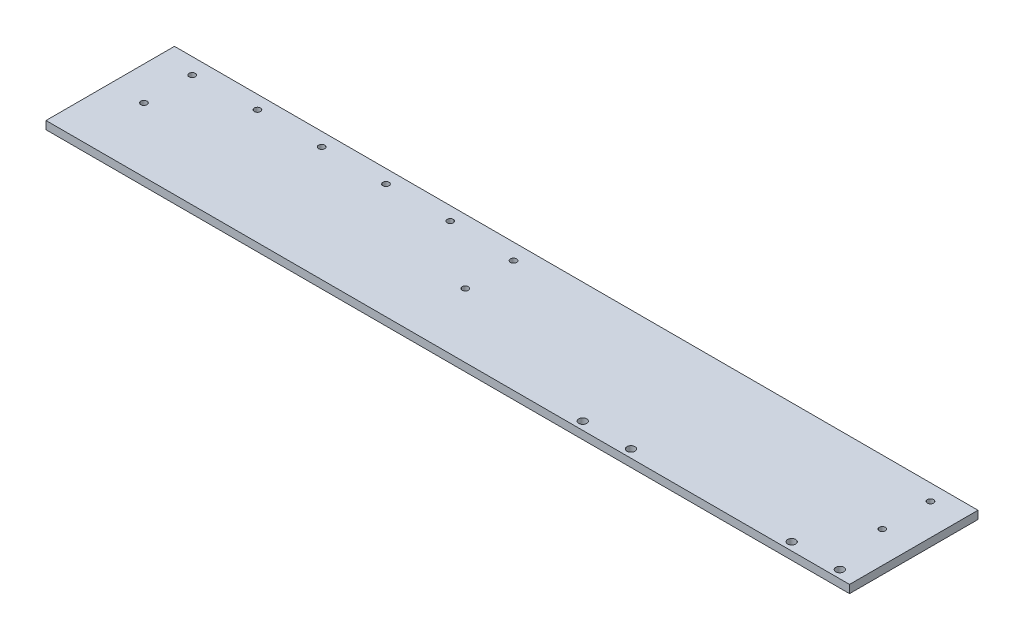
ISO-10303-21;
HEADER;
FILE_DESCRIPTION(('STEP AP214'),'2;1');
FILE_NAME('part.step','',(''),(''),'','','');
FILE_SCHEMA(('AUTOMOTIVE_DESIGN { 1 0 10303 214 1 1 1 1 }'));
ENDSEC;
DATA;
#1=APPLICATION_CONTEXT('core data for automotive mechanical design processes');
#2=APPLICATION_PROTOCOL_DEFINITION('international standard','automotive_design',2000,#1);
#3=PRODUCT_CONTEXT('',#1,'mechanical');
#4=PRODUCT('Part','Part','',(#3));
#5=PRODUCT_RELATED_PRODUCT_CATEGORY('part','',(#4));
#6=PRODUCT_DEFINITION_FORMATION('','',#4);
#7=PRODUCT_DEFINITION_CONTEXT('part definition',#1,'design');
#8=PRODUCT_DEFINITION('design','',#6,#7);
#9=PRODUCT_DEFINITION_SHAPE('','',#8);
#10=(LENGTH_UNIT() NAMED_UNIT(*) SI_UNIT(.MILLI.,.METRE.));
#11=(NAMED_UNIT(*) PLANE_ANGLE_UNIT() SI_UNIT($,.RADIAN.));
#12=(NAMED_UNIT(*) SI_UNIT($,.STERADIAN.) SOLID_ANGLE_UNIT());
#13=UNCERTAINTY_MEASURE_WITH_UNIT(LENGTH_MEASURE(1.E-05),#10,'distance_accuracy_value','');
#14=(GEOMETRIC_REPRESENTATION_CONTEXT(3) GLOBAL_UNCERTAINTY_ASSIGNED_CONTEXT((#13)) GLOBAL_UNIT_ASSIGNED_CONTEXT((#10,
#11,#12)) REPRESENTATION_CONTEXT('',''));
#15=CARTESIAN_POINT('',(0.,0.,0.));
#16=DIRECTION('',(0.,0.,1.));
#17=DIRECTION('',(1.,0.,0.));
#18=AXIS2_PLACEMENT_3D('',#15,#16,#17);
#19=CARTESIAN_POINT('',(0.,6.35,0.));
#20=DIRECTION('',(0.,1.,0.));
#21=DIRECTION('',(0.,0.,1.));
#22=AXIS2_PLACEMENT_3D('',#19,#20,#21);
#23=PLANE('',#22);
#24=CARTESIAN_POINT('',(-139.700000000015,6.35,-40.0955048344385));
#25=DIRECTION('',(0.,1.,0.));
#26=DIRECTION('',(0.,0.,1.));
#27=AXIS2_PLACEMENT_3D('',#24,#25,#26);
#28=CIRCLE('',#27,2.4638);
#29=CARTESIAN_POINT('',(-139.700000000015,6.35,-37.6317048344385));
#30=VERTEX_POINT('',#29);
#31=EDGE_CURVE('E224',#30,#30,#28,.T.);
#32=ORIENTED_EDGE('',*,*,#31,.F.);
#33=EDGE_LOOP('',(#32));
#34=FACE_BOUND('',#33,.T.);
#35=CARTESIAN_POINT('',(303.53,6.35,44.4135048360669));
#36=DIRECTION('',(0.,1.,0.));
#37=DIRECTION('',(0.,0.,1.));
#38=AXIS2_PLACEMENT_3D('',#35,#36,#37);
#39=CIRCLE('',#38,3.17499999999997);
#40=CARTESIAN_POINT('',(303.53,6.35,47.5885048360669));
#41=VERTEX_POINT('',#40);
#42=EDGE_CURVE('E208',#41,#41,#39,.T.);
#43=ORIENTED_EDGE('',*,*,#42,.F.);
#44=EDGE_LOOP('',(#43));
#45=FACE_BOUND('',#44,.T.);
#46=CARTESIAN_POINT('',(-190.500000000015,6.35,-40.0955048344385));
#47=DIRECTION('',(0.,1.,0.));
#48=DIRECTION('',(0.,0.,1.));
#49=AXIS2_PLACEMENT_3D('',#46,#47,#48);
#50=CIRCLE('',#49,2.4638);
#51=CARTESIAN_POINT('',(-190.500000000015,6.35,-37.6317048344385));
#52=VERTEX_POINT('',#51);
#53=EDGE_CURVE('E192',#52,#52,#50,.T.);
#54=ORIENTED_EDGE('',*,*,#53,.F.);
#55=EDGE_LOOP('',(#54));
#56=FACE_BOUND('',#55,.T.);
#57=CARTESIAN_POINT('',(100.33,6.35,44.4135048360669));
#58=DIRECTION('',(0.,1.,0.));
#59=DIRECTION('',(0.,0.,1.));
#60=AXIS2_PLACEMENT_3D('',#57,#58,#59);
#61=CIRCLE('',#60,3.175);
#62=CARTESIAN_POINT('',(100.33,6.35,47.5885048360669));
#63=VERTEX_POINT('',#62);
#64=EDGE_CURVE('E176',#63,#63,#61,.T.);
#65=ORIENTED_EDGE('',*,*,#64,.F.);
#66=EDGE_LOOP('',(#65));
#67=FACE_BOUND('',#66,.T.);
#68=CARTESIAN_POINT('',(-36.8299999984826,6.35,0.0364951624271248));
#69=DIRECTION('',(0.,1.,0.));
#70=DIRECTION('',(0.,0.,1.));
#71=AXIS2_PLACEMENT_3D('',#68,#69,#70);
#72=CIRCLE('',#71,2.4638);
#73=CARTESIAN_POINT('',(-36.8299999984826,6.35,2.50029516242713));
#74=VERTEX_POINT('',#73);
#75=EDGE_CURVE('E160',#74,#74,#72,.T.);
#76=ORIENTED_EDGE('',*,*,#75,.F.);
#77=EDGE_LOOP('',(#76));
#78=FACE_BOUND('',#77,.T.);
#79=CARTESIAN_POINT('',(292.608,6.35,-0.0364951639330591));
#80=DIRECTION('',(0.,1.,0.));
#81=DIRECTION('',(0.,0.,1.));
#82=AXIS2_PLACEMENT_3D('',#79,#80,#81);
#83=CIRCLE('',#82,2.4638);
#84=CARTESIAN_POINT('',(292.608,6.35,2.42730483606694));
#85=VERTEX_POINT('',#84);
#86=EDGE_CURVE('E144',#85,#85,#83,.T.);
#87=ORIENTED_EDGE('',*,*,#86,.F.);
#88=EDGE_LOOP('',(#87));
#89=FACE_BOUND('',#88,.T.);
#90=CARTESIAN_POINT('',(-290.83,6.35,-38.0635048360632));
#91=DIRECTION('',(0.,1.,0.));
#92=DIRECTION('',(0.,0.,1.));
#93=AXIS2_PLACEMENT_3D('',#90,#91,#92);
#94=CIRCLE('',#93,2.4638);
#95=CARTESIAN_POINT('',(-290.83,6.35,-35.5997048360632));
#96=VERTEX_POINT('',#95);
#97=EDGE_CURVE('E114',#96,#96,#94,.T.);
#98=ORIENTED_EDGE('',*,*,#97,.F.);
#99=EDGE_LOOP('',(#98));
#100=FACE_BOUND('',#99,.T.);
#101=DIRECTION('',(0.,0.,1.));
#102=VECTOR('',#101,1.);
#103=CARTESIAN_POINT('',(-317.5,6.35,50.763504836067));
#104=LINE('',#103,#102);
#105=CARTESIAN_POINT('',(-317.5,6.35,-50.763504836067));
#106=VERTEX_POINT('',#105);
#107=CARTESIAN_POINT('',(-317.5,6.35,50.763504836067));
#108=VERTEX_POINT('',#107);
#109=EDGE_CURVE('E94',#106,#108,#104,.T.);
#110=ORIENTED_EDGE('',*,*,#109,.T.);
#111=DIRECTION('',(1.,0.,0.));
#112=VECTOR('',#111,1.);
#113=CARTESIAN_POINT('',(317.5,6.35,50.763504836067));
#114=LINE('',#113,#112);
#115=CARTESIAN_POINT('',(317.5,6.35,50.763504836067));
#116=VERTEX_POINT('',#115);
#117=EDGE_CURVE('E89',#108,#116,#114,.T.);
#118=ORIENTED_EDGE('',*,*,#117,.T.);
#119=DIRECTION('',(0.,0.,-1.));
#120=VECTOR('',#119,1.);
#121=CARTESIAN_POINT('',(317.5,6.35,50.763504836067));
#122=LINE('',#121,#120);
#123=CARTESIAN_POINT('',(317.5,6.35,-50.763504836067));
#124=VERTEX_POINT('',#123);
#125=EDGE_CURVE('E92',#116,#124,#122,.T.);
#126=ORIENTED_EDGE('',*,*,#125,.T.);
#127=DIRECTION('',(-1.,0.,0.));
#128=VECTOR('',#127,1.);
#129=CARTESIAN_POINT('',(317.5,6.35,-50.763504836067));
#130=LINE('',#129,#128);
#131=EDGE_CURVE('E59',#124,#106,#130,.T.);
#132=ORIENTED_EDGE('',*,*,#131,.T.);
#133=EDGE_LOOP('',(#110,#118,#126,#132));
#134=FACE_BOUND('',#133,.T.);
#135=CARTESIAN_POINT('',(-290.83,6.35,0.0364951639368061));
#136=DIRECTION('',(0.,1.,0.));
#137=DIRECTION('',(0.,0.,1.));
#138=AXIS2_PLACEMENT_3D('',#135,#136,#137);
#139=CIRCLE('',#138,2.4638);
#140=CARTESIAN_POINT('',(-290.83,6.35,2.50029516393681));
#141=VERTEX_POINT('',#140);
#142=EDGE_CURVE('E136',#141,#141,#139,.T.);
#143=ORIENTED_EDGE('',*,*,#142,.F.);
#144=EDGE_LOOP('',(#143));
#145=FACE_BOUND('',#144,.T.);
#146=CARTESIAN_POINT('',(292.608,6.35,-38.063504836067));
#147=DIRECTION('',(0.,1.,0.));
#148=DIRECTION('',(0.,0.,1.));
#149=AXIS2_PLACEMENT_3D('',#146,#147,#148);
#150=CIRCLE('',#149,2.4638);
#151=CARTESIAN_POINT('',(292.608,6.35,-35.599704836067));
#152=VERTEX_POINT('',#151);
#153=EDGE_CURVE('E152',#152,#152,#150,.T.);
#154=ORIENTED_EDGE('',*,*,#153,.F.);
#155=EDGE_LOOP('',(#154));
#156=FACE_BOUND('',#155,.T.);
#157=CARTESIAN_POINT('',(-241.300000000015,6.35,-40.0955048344385));
#158=DIRECTION('',(0.,1.,0.));
#159=DIRECTION('',(0.,0.,1.));
#160=AXIS2_PLACEMENT_3D('',#157,#158,#159);
#161=CIRCLE('',#160,2.4638);
#162=CARTESIAN_POINT('',(-241.300000000015,6.35,-37.6317048344385));
#163=VERTEX_POINT('',#162);
#164=EDGE_CURVE('E168',#163,#163,#161,.T.);
#165=ORIENTED_EDGE('',*,*,#164,.F.);
#166=EDGE_LOOP('',(#165));
#167=FACE_BOUND('',#166,.T.);
#168=CARTESIAN_POINT('',(-36.8299999984826,6.35,-38.0635048375729));
#169=DIRECTION('',(0.,1.,0.));
#170=DIRECTION('',(0.,0.,1.));
#171=AXIS2_PLACEMENT_3D('',#168,#169,#170);
#172=CIRCLE('',#171,2.4638);
#173=CARTESIAN_POINT('',(-36.8299999984826,6.35,-35.5997048375729));
#174=VERTEX_POINT('',#173);
#175=EDGE_CURVE('E184',#174,#174,#172,.T.);
#176=ORIENTED_EDGE('',*,*,#175,.F.);
#177=EDGE_LOOP('',(#176));
#178=FACE_BOUND('',#177,.T.);
#179=CARTESIAN_POINT('',(138.43,6.35,44.4135048360669));
#180=DIRECTION('',(0.,1.,0.));
#181=DIRECTION('',(0.,0.,1.));
#182=AXIS2_PLACEMENT_3D('',#179,#180,#181);
#183=CIRCLE('',#182,3.17499999999997);
#184=CARTESIAN_POINT('',(138.43,6.35,47.5885048360669));
#185=VERTEX_POINT('',#184);
#186=EDGE_CURVE('E200',#185,#185,#183,.T.);
#187=ORIENTED_EDGE('',*,*,#186,.F.);
#188=EDGE_LOOP('',(#187));
#189=FACE_BOUND('',#188,.T.);
#190=CARTESIAN_POINT('',(265.43,6.35,44.4135048360669));
#191=DIRECTION('',(0.,1.,0.));
#192=DIRECTION('',(0.,0.,1.));
#193=AXIS2_PLACEMENT_3D('',#190,#191,#192);
#194=CIRCLE('',#193,3.17499999999997);
#195=CARTESIAN_POINT('',(265.43,6.35,47.5885048360669));
#196=VERTEX_POINT('',#195);
#197=EDGE_CURVE('E216',#196,#196,#194,.T.);
#198=ORIENTED_EDGE('',*,*,#197,.F.);
#199=EDGE_LOOP('',(#198));
#200=FACE_BOUND('',#199,.T.);
#201=CARTESIAN_POINT('',(-88.9000000000148,6.35,-40.0955048344385));
#202=DIRECTION('',(0.,1.,0.));
#203=DIRECTION('',(0.,0.,1.));
#204=AXIS2_PLACEMENT_3D('',#201,#202,#203);
#205=CIRCLE('',#204,2.4638);
#206=CARTESIAN_POINT('',(-88.9000000000148,6.35,-37.6317048344385));
#207=VERTEX_POINT('',#206);
#208=EDGE_CURVE('E232',#207,#207,#205,.T.);
#209=ORIENTED_EDGE('',*,*,#208,.F.);
#210=EDGE_LOOP('',(#209));
#211=FACE_BOUND('',#210,.T.);
#212=ADVANCED_FACE('F41',(#34,#45,#56,#67,#78,#89,#100,#134,#145,#156,#167,#178,#189,#200,#211),
#23,.T.);
#213=CARTESIAN_POINT('',(0.,0.,0.));
#214=DIRECTION('',(0.,1.,0.));
#215=DIRECTION('',(0.,0.,1.));
#216=AXIS2_PLACEMENT_3D('',#213,#214,#215);
#217=PLANE('',#216);
#218=DIRECTION('',(0.,0.,1.));
#219=VECTOR('',#218,1.);
#220=CARTESIAN_POINT('',(-317.5,0.,50.763504836067));
#221=LINE('',#220,#219);
#222=CARTESIAN_POINT('',(-317.5,0.,-50.763504836067));
#223=VERTEX_POINT('',#222);
#224=CARTESIAN_POINT('',(-317.5,0.,50.763504836067));
#225=VERTEX_POINT('',#224);
#226=EDGE_CURVE('E110',#223,#225,#221,.T.);
#227=ORIENTED_EDGE('',*,*,#226,.F.);
#228=DIRECTION('',(-1.,0.,0.));
#229=VECTOR('',#228,1.);
#230=CARTESIAN_POINT('',(317.5,0.,-50.763504836067));
#231=LINE('',#230,#229);
#232=CARTESIAN_POINT('',(317.5,0.,-50.763504836067));
#233=VERTEX_POINT('',#232);
#234=EDGE_CURVE('E82',#233,#223,#231,.T.);
#235=ORIENTED_EDGE('',*,*,#234,.F.);
#236=DIRECTION('',(0.,0.,-1.));
#237=VECTOR('',#236,1.);
#238=CARTESIAN_POINT('',(317.5,0.,50.763504836067));
#239=LINE('',#238,#237);
#240=CARTESIAN_POINT('',(317.5,0.,50.763504836067));
#241=VERTEX_POINT('',#240);
#242=EDGE_CURVE('E76',#241,#233,#239,.T.);
#243=ORIENTED_EDGE('',*,*,#242,.F.);
#244=DIRECTION('',(1.,0.,0.));
#245=VECTOR('',#244,1.);
#246=CARTESIAN_POINT('',(317.5,0.,50.763504836067));
#247=LINE('',#246,#245);
#248=EDGE_CURVE('E99',#225,#241,#247,.T.);
#249=ORIENTED_EDGE('',*,*,#248,.F.);
#250=EDGE_LOOP('',(#227,#235,#243,#249));
#251=FACE_BOUND('',#250,.T.);
#252=CARTESIAN_POINT('',(-290.83,0.,-38.0635048360632));
#253=DIRECTION('',(0.,1.,0.));
#254=DIRECTION('',(0.,0.,1.));
#255=AXIS2_PLACEMENT_3D('',#252,#253,#254);
#256=CIRCLE('',#255,2.4638);
#257=CARTESIAN_POINT('',(-290.83,0.,-35.5997048360632));
#258=VERTEX_POINT('',#257);
#259=EDGE_CURVE('E132',#258,#258,#256,.T.);
#260=ORIENTED_EDGE('',*,*,#259,.T.);
#261=EDGE_LOOP('',(#260));
#262=FACE_BOUND('',#261,.T.);
#263=CARTESIAN_POINT('',(-290.83,0.,0.0364951639368061));
#264=DIRECTION('',(0.,1.,0.));
#265=DIRECTION('',(0.,0.,1.));
#266=AXIS2_PLACEMENT_3D('',#263,#264,#265);
#267=CIRCLE('',#266,2.4638);
#268=CARTESIAN_POINT('',(-290.83,0.,2.50029516393681));
#269=VERTEX_POINT('',#268);
#270=EDGE_CURVE('E140',#269,#269,#267,.T.);
#271=ORIENTED_EDGE('',*,*,#270,.T.);
#272=EDGE_LOOP('',(#271));
#273=FACE_BOUND('',#272,.T.);
#274=CARTESIAN_POINT('',(292.608,0.,-0.0364951639330591));
#275=DIRECTION('',(0.,1.,0.));
#276=DIRECTION('',(0.,0.,1.));
#277=AXIS2_PLACEMENT_3D('',#274,#275,#276);
#278=CIRCLE('',#277,2.4638);
#279=CARTESIAN_POINT('',(292.608,0.,2.42730483606694));
#280=VERTEX_POINT('',#279);
#281=EDGE_CURVE('E148',#280,#280,#278,.T.);
#282=ORIENTED_EDGE('',*,*,#281,.T.);
#283=EDGE_LOOP('',(#282));
#284=FACE_BOUND('',#283,.T.);
#285=CARTESIAN_POINT('',(292.608,0.,-38.063504836067));
#286=DIRECTION('',(0.,1.,0.));
#287=DIRECTION('',(0.,0.,1.));
#288=AXIS2_PLACEMENT_3D('',#285,#286,#287);
#289=CIRCLE('',#288,2.4638);
#290=CARTESIAN_POINT('',(292.608,0.,-35.599704836067));
#291=VERTEX_POINT('',#290);
#292=EDGE_CURVE('E156',#291,#291,#289,.T.);
#293=ORIENTED_EDGE('',*,*,#292,.T.);
#294=EDGE_LOOP('',(#293));
#295=FACE_BOUND('',#294,.T.);
#296=CARTESIAN_POINT('',(-36.8299999984826,0.,0.0364951624271248));
#297=DIRECTION('',(0.,1.,0.));
#298=DIRECTION('',(0.,0.,1.));
#299=AXIS2_PLACEMENT_3D('',#296,#297,#298);
#300=CIRCLE('',#299,2.4638);
#301=CARTESIAN_POINT('',(-36.8299999984826,0.,2.50029516242713));
#302=VERTEX_POINT('',#301);
#303=EDGE_CURVE('E164',#302,#302,#300,.T.);
#304=ORIENTED_EDGE('',*,*,#303,.T.);
#305=EDGE_LOOP('',(#304));
#306=FACE_BOUND('',#305,.T.);
#307=CARTESIAN_POINT('',(-241.300000000015,0.,-40.0955048344385));
#308=DIRECTION('',(0.,1.,0.));
#309=DIRECTION('',(0.,0.,1.));
#310=AXIS2_PLACEMENT_3D('',#307,#308,#309);
#311=CIRCLE('',#310,2.4638);
#312=CARTESIAN_POINT('',(-241.300000000015,0.,-37.6317048344385));
#313=VERTEX_POINT('',#312);
#314=EDGE_CURVE('E172',#313,#313,#311,.T.);
#315=ORIENTED_EDGE('',*,*,#314,.T.);
#316=EDGE_LOOP('',(#315));
#317=FACE_BOUND('',#316,.T.);
#318=CARTESIAN_POINT('',(100.33,0.,44.4135048360669));
#319=DIRECTION('',(0.,1.,0.));
#320=DIRECTION('',(0.,0.,1.));
#321=AXIS2_PLACEMENT_3D('',#318,#319,#320);
#322=CIRCLE('',#321,3.175);
#323=CARTESIAN_POINT('',(100.33,0.,47.5885048360669));
#324=VERTEX_POINT('',#323);
#325=EDGE_CURVE('E180',#324,#324,#322,.T.);
#326=ORIENTED_EDGE('',*,*,#325,.T.);
#327=EDGE_LOOP('',(#326));
#328=FACE_BOUND('',#327,.T.);
#329=CARTESIAN_POINT('',(-36.8299999984826,0.,-38.0635048375729));
#330=DIRECTION('',(0.,1.,0.));
#331=DIRECTION('',(0.,0.,1.));
#332=AXIS2_PLACEMENT_3D('',#329,#330,#331);
#333=CIRCLE('',#332,2.4638);
#334=CARTESIAN_POINT('',(-36.8299999984826,0.,-35.5997048375729));
#335=VERTEX_POINT('',#334);
#336=EDGE_CURVE('E188',#335,#335,#333,.T.);
#337=ORIENTED_EDGE('',*,*,#336,.T.);
#338=EDGE_LOOP('',(#337));
#339=FACE_BOUND('',#338,.T.);
#340=CARTESIAN_POINT('',(-190.500000000015,0.,-40.0955048344385));
#341=DIRECTION('',(0.,1.,0.));
#342=DIRECTION('',(0.,0.,1.));
#343=AXIS2_PLACEMENT_3D('',#340,#341,#342);
#344=CIRCLE('',#343,2.4638);
#345=CARTESIAN_POINT('',(-190.500000000015,0.,-37.6317048344385));
#346=VERTEX_POINT('',#345);
#347=EDGE_CURVE('E196',#346,#346,#344,.T.);
#348=ORIENTED_EDGE('',*,*,#347,.T.);
#349=EDGE_LOOP('',(#348));
#350=FACE_BOUND('',#349,.T.);
#351=CARTESIAN_POINT('',(138.43,0.,44.4135048360669));
#352=DIRECTION('',(0.,1.,0.));
#353=DIRECTION('',(0.,0.,1.));
#354=AXIS2_PLACEMENT_3D('',#351,#352,#353);
#355=CIRCLE('',#354,3.17499999999997);
#356=CARTESIAN_POINT('',(138.43,0.,47.5885048360669));
#357=VERTEX_POINT('',#356);
#358=EDGE_CURVE('E204',#357,#357,#355,.T.);
#359=ORIENTED_EDGE('',*,*,#358,.T.);
#360=EDGE_LOOP('',(#359));
#361=FACE_BOUND('',#360,.T.);
#362=CARTESIAN_POINT('',(303.53,0.,44.4135048360669));
#363=DIRECTION('',(0.,1.,0.));
#364=DIRECTION('',(0.,0.,1.));
#365=AXIS2_PLACEMENT_3D('',#362,#363,#364);
#366=CIRCLE('',#365,3.17499999999997);
#367=CARTESIAN_POINT('',(303.53,0.,47.5885048360669));
#368=VERTEX_POINT('',#367);
#369=EDGE_CURVE('E212',#368,#368,#366,.T.);
#370=ORIENTED_EDGE('',*,*,#369,.T.);
#371=EDGE_LOOP('',(#370));
#372=FACE_BOUND('',#371,.T.);
#373=CARTESIAN_POINT('',(265.43,0.,44.4135048360669));
#374=DIRECTION('',(0.,1.,0.));
#375=DIRECTION('',(0.,0.,1.));
#376=AXIS2_PLACEMENT_3D('',#373,#374,#375);
#377=CIRCLE('',#376,3.17499999999997);
#378=CARTESIAN_POINT('',(265.43,0.,47.5885048360669));
#379=VERTEX_POINT('',#378);
#380=EDGE_CURVE('E220',#379,#379,#377,.T.);
#381=ORIENTED_EDGE('',*,*,#380,.T.);
#382=EDGE_LOOP('',(#381));
#383=FACE_BOUND('',#382,.T.);
#384=CARTESIAN_POINT('',(-139.700000000015,0.,-40.0955048344385));
#385=DIRECTION('',(0.,1.,0.));
#386=DIRECTION('',(0.,0.,1.));
#387=AXIS2_PLACEMENT_3D('',#384,#385,#386);
#388=CIRCLE('',#387,2.4638);
#389=CARTESIAN_POINT('',(-139.700000000015,0.,-37.6317048344385));
#390=VERTEX_POINT('',#389);
#391=EDGE_CURVE('E228',#390,#390,#388,.T.);
#392=ORIENTED_EDGE('',*,*,#391,.T.);
#393=EDGE_LOOP('',(#392));
#394=FACE_BOUND('',#393,.T.);
#395=CARTESIAN_POINT('',(-88.9000000000148,0.,-40.0955048344385));
#396=DIRECTION('',(0.,1.,0.));
#397=DIRECTION('',(0.,0.,1.));
#398=AXIS2_PLACEMENT_3D('',#395,#396,#397);
#399=CIRCLE('',#398,2.4638);
#400=CARTESIAN_POINT('',(-88.9000000000148,0.,-37.6317048344385));
#401=VERTEX_POINT('',#400);
#402=EDGE_CURVE('E236',#401,#401,#399,.T.);
#403=ORIENTED_EDGE('',*,*,#402,.T.);
#404=EDGE_LOOP('',(#403));
#405=FACE_BOUND('',#404,.T.);
#406=ADVANCED_FACE('F127',(#251,#262,#273,#284,#295,#306,#317,#328,#339,#350,#361,#372,#383,
#394,#405),#217,.F.);
#407=CARTESIAN_POINT('',(-317.5,6.35,50.763504836067));
#408=DIRECTION('',(1.,0.,0.));
#409=DIRECTION('',(0.,0.,-1.));
#410=AXIS2_PLACEMENT_3D('',#407,#408,#409);
#411=PLANE('',#410);
#412=ORIENTED_EDGE('',*,*,#226,.T.);
#413=DIRECTION('',(0.,-1.,0.));
#414=VECTOR('',#413,1.);
#415=CARTESIAN_POINT('',(-317.5,6.35,50.763504836067));
#416=LINE('',#415,#414);
#417=EDGE_CURVE('E11',#108,#225,#416,.T.);
#418=ORIENTED_EDGE('',*,*,#417,.F.);
#419=ORIENTED_EDGE('',*,*,#109,.F.);
#420=DIRECTION('',(0.,-1.,0.));
#421=VECTOR('',#420,1.);
#422=CARTESIAN_POINT('',(-317.5,6.35,-50.763504836067));
#423=LINE('',#422,#421);
#424=EDGE_CURVE('E106',#106,#223,#423,.T.);
#425=ORIENTED_EDGE('',*,*,#424,.T.);
#426=EDGE_LOOP('',(#412,#418,#419,#425));
#427=FACE_BOUND('',#426,.T.);
#428=ADVANCED_FACE('F43',(#427),#411,.F.);
#429=CARTESIAN_POINT('',(317.5,6.35,50.763504836067));
#430=DIRECTION('',(0.,0.,-1.));
#431=DIRECTION('',(-1.,0.,0.));
#432=AXIS2_PLACEMENT_3D('',#429,#430,#431);
#433=PLANE('',#432);
#434=ORIENTED_EDGE('',*,*,#248,.T.);
#435=DIRECTION('',(0.,-1.,0.));
#436=VECTOR('',#435,1.);
#437=CARTESIAN_POINT('',(317.5,6.35,50.763504836067));
#438=LINE('',#437,#436);
#439=EDGE_CURVE('E51',#116,#241,#438,.T.);
#440=ORIENTED_EDGE('',*,*,#439,.F.);
#441=ORIENTED_EDGE('',*,*,#117,.F.);
#442=ORIENTED_EDGE('',*,*,#417,.T.);
#443=EDGE_LOOP('',(#434,#440,#441,#442));
#444=FACE_BOUND('',#443,.T.);
#445=ADVANCED_FACE('F98',(#444),#433,.F.);
#446=CARTESIAN_POINT('',(317.5,6.35,50.763504836067));
#447=DIRECTION('',(-1.,0.,0.));
#448=DIRECTION('',(0.,0.,1.));
#449=AXIS2_PLACEMENT_3D('',#446,#447,#448);
#450=PLANE('',#449);
#451=ORIENTED_EDGE('',*,*,#242,.T.);
#452=DIRECTION('',(0.,-1.,0.));
#453=VECTOR('',#452,1.);
#454=CARTESIAN_POINT('',(317.5,6.35,-50.763504836067));
#455=LINE('',#454,#453);
#456=EDGE_CURVE('E101',#124,#233,#455,.T.);
#457=ORIENTED_EDGE('',*,*,#456,.F.);
#458=ORIENTED_EDGE('',*,*,#125,.F.);
#459=ORIENTED_EDGE('',*,*,#439,.T.);
#460=EDGE_LOOP('',(#451,#457,#458,#459));
#461=FACE_BOUND('',#460,.T.);
#462=ADVANCED_FACE('F102',(#461),#450,.F.);
#463=CARTESIAN_POINT('',(317.5,6.35,-50.763504836067));
#464=DIRECTION('',(0.,0.,1.));
#465=DIRECTION('',(1.,0.,0.));
#466=AXIS2_PLACEMENT_3D('',#463,#464,#465);
#467=PLANE('',#466);
#468=ORIENTED_EDGE('',*,*,#234,.T.);
#469=ORIENTED_EDGE('',*,*,#424,.F.);
#470=ORIENTED_EDGE('',*,*,#131,.F.);
#471=ORIENTED_EDGE('',*,*,#456,.T.);
#472=EDGE_LOOP('',(#468,#469,#470,#471));
#473=FACE_BOUND('',#472,.T.);
#474=ADVANCED_FACE('F124',(#473),#467,.F.);
#475=CARTESIAN_POINT('',(-290.83,6.35,-38.0635048360632));
#476=DIRECTION('',(0.,-1.,0.));
#477=DIRECTION('',(0.,0.,-1.));
#478=AXIS2_PLACEMENT_3D('',#475,#476,#477);
#479=CYLINDRICAL_SURFACE('',#478,2.4638);
#480=ORIENTED_EDGE('',*,*,#97,.T.);
#481=EDGE_LOOP('',(#480));
#482=FACE_BOUND('',#481,.T.);
#483=ORIENTED_EDGE('',*,*,#259,.F.);
#484=EDGE_LOOP('',(#483));
#485=FACE_BOUND('',#484,.T.);
#486=ADVANCED_FACE('F257',(#482,#485),#479,.F.);
#487=CARTESIAN_POINT('',(-290.83,6.35,0.0364951639368061));
#488=DIRECTION('',(0.,-1.,0.));
#489=DIRECTION('',(0.,0.,-1.));
#490=AXIS2_PLACEMENT_3D('',#487,#488,#489);
#491=CYLINDRICAL_SURFACE('',#490,2.4638);
#492=ORIENTED_EDGE('',*,*,#142,.T.);
#493=EDGE_LOOP('',(#492));
#494=FACE_BOUND('',#493,.T.);
#495=ORIENTED_EDGE('',*,*,#270,.F.);
#496=EDGE_LOOP('',(#495));
#497=FACE_BOUND('',#496,.T.);
#498=ADVANCED_FACE('F303',(#494,#497),#491,.F.);
#499=CARTESIAN_POINT('',(292.608,6.35,-0.0364951639330591));
#500=DIRECTION('',(0.,-1.,0.));
#501=DIRECTION('',(0.,0.,-1.));
#502=AXIS2_PLACEMENT_3D('',#499,#500,#501);
#503=CYLINDRICAL_SURFACE('',#502,2.4638);
#504=ORIENTED_EDGE('',*,*,#86,.T.);
#505=EDGE_LOOP('',(#504));
#506=FACE_BOUND('',#505,.T.);
#507=ORIENTED_EDGE('',*,*,#281,.F.);
#508=EDGE_LOOP('',(#507));
#509=FACE_BOUND('',#508,.T.);
#510=ADVANCED_FACE('F311',(#506,#509),#503,.F.);
#511=CARTESIAN_POINT('',(292.608,6.35,-38.063504836067));
#512=DIRECTION('',(0.,-1.,0.));
#513=DIRECTION('',(0.,0.,-1.));
#514=AXIS2_PLACEMENT_3D('',#511,#512,#513);
#515=CYLINDRICAL_SURFACE('',#514,2.4638);
#516=ORIENTED_EDGE('',*,*,#153,.T.);
#517=EDGE_LOOP('',(#516));
#518=FACE_BOUND('',#517,.T.);
#519=ORIENTED_EDGE('',*,*,#292,.F.);
#520=EDGE_LOOP('',(#519));
#521=FACE_BOUND('',#520,.T.);
#522=ADVANCED_FACE('F319',(#518,#521),#515,.F.);
#523=CARTESIAN_POINT('',(-36.8299999984826,6.35,0.0364951624271248));
#524=DIRECTION('',(0.,-1.,0.));
#525=DIRECTION('',(0.,0.,-1.));
#526=AXIS2_PLACEMENT_3D('',#523,#524,#525);
#527=CYLINDRICAL_SURFACE('',#526,2.4638);
#528=ORIENTED_EDGE('',*,*,#75,.T.);
#529=EDGE_LOOP('',(#528));
#530=FACE_BOUND('',#529,.T.);
#531=ORIENTED_EDGE('',*,*,#303,.F.);
#532=EDGE_LOOP('',(#531));
#533=FACE_BOUND('',#532,.T.);
#534=ADVANCED_FACE('F328',(#530,#533),#527,.F.);
#535=CARTESIAN_POINT('',(-241.300000000015,6.35,-40.0955048344385));
#536=DIRECTION('',(0.,-1.,0.));
#537=DIRECTION('',(0.,0.,-1.));
#538=AXIS2_PLACEMENT_3D('',#535,#536,#537);
#539=CYLINDRICAL_SURFACE('',#538,2.4638);
#540=ORIENTED_EDGE('',*,*,#164,.T.);
#541=EDGE_LOOP('',(#540));
#542=FACE_BOUND('',#541,.T.);
#543=ORIENTED_EDGE('',*,*,#314,.F.);
#544=EDGE_LOOP('',(#543));
#545=FACE_BOUND('',#544,.T.);
#546=ADVANCED_FACE('F337',(#542,#545),#539,.F.);
#547=CARTESIAN_POINT('',(100.33,6.35,44.4135048360669));
#548=DIRECTION('',(0.,-1.,0.));
#549=DIRECTION('',(0.,0.,-1.));
#550=AXIS2_PLACEMENT_3D('',#547,#548,#549);
#551=CYLINDRICAL_SURFACE('',#550,3.175);
#552=ORIENTED_EDGE('',*,*,#64,.T.);
#553=EDGE_LOOP('',(#552));
#554=FACE_BOUND('',#553,.T.);
#555=ORIENTED_EDGE('',*,*,#325,.F.);
#556=EDGE_LOOP('',(#555));
#557=FACE_BOUND('',#556,.T.);
#558=ADVANCED_FACE('F346',(#554,#557),#551,.F.);
#559=CARTESIAN_POINT('',(-36.8299999984826,6.35,-38.0635048375729));
#560=DIRECTION('',(0.,-1.,0.));
#561=DIRECTION('',(0.,0.,-1.));
#562=AXIS2_PLACEMENT_3D('',#559,#560,#561);
#563=CYLINDRICAL_SURFACE('',#562,2.4638);
#564=ORIENTED_EDGE('',*,*,#175,.T.);
#565=EDGE_LOOP('',(#564));
#566=FACE_BOUND('',#565,.T.);
#567=ORIENTED_EDGE('',*,*,#336,.F.);
#568=EDGE_LOOP('',(#567));
#569=FACE_BOUND('',#568,.T.);
#570=ADVANCED_FACE('F355',(#566,#569),#563,.F.);
#571=CARTESIAN_POINT('',(-190.500000000015,6.35,-40.0955048344385));
#572=DIRECTION('',(0.,-1.,0.));
#573=DIRECTION('',(0.,0.,-1.));
#574=AXIS2_PLACEMENT_3D('',#571,#572,#573);
#575=CYLINDRICAL_SURFACE('',#574,2.4638);
#576=ORIENTED_EDGE('',*,*,#53,.T.);
#577=EDGE_LOOP('',(#576));
#578=FACE_BOUND('',#577,.T.);
#579=ORIENTED_EDGE('',*,*,#347,.F.);
#580=EDGE_LOOP('',(#579));
#581=FACE_BOUND('',#580,.T.);
#582=ADVANCED_FACE('F364',(#578,#581),#575,.F.);
#583=CARTESIAN_POINT('',(138.43,6.35,44.4135048360669));
#584=DIRECTION('',(0.,-1.,0.));
#585=DIRECTION('',(0.,0.,-1.));
#586=AXIS2_PLACEMENT_3D('',#583,#584,#585);
#587=CYLINDRICAL_SURFACE('',#586,3.17499999999997);
#588=ORIENTED_EDGE('',*,*,#186,.T.);
#589=EDGE_LOOP('',(#588));
#590=FACE_BOUND('',#589,.T.);
#591=ORIENTED_EDGE('',*,*,#358,.F.);
#592=EDGE_LOOP('',(#591));
#593=FACE_BOUND('',#592,.T.);
#594=ADVANCED_FACE('F373',(#590,#593),#587,.F.);
#595=CARTESIAN_POINT('',(303.53,6.35,44.4135048360669));
#596=DIRECTION('',(0.,-1.,0.));
#597=DIRECTION('',(0.,0.,-1.));
#598=AXIS2_PLACEMENT_3D('',#595,#596,#597);
#599=CYLINDRICAL_SURFACE('',#598,3.17499999999997);
#600=ORIENTED_EDGE('',*,*,#42,.T.);
#601=EDGE_LOOP('',(#600));
#602=FACE_BOUND('',#601,.T.);
#603=ORIENTED_EDGE('',*,*,#369,.F.);
#604=EDGE_LOOP('',(#603));
#605=FACE_BOUND('',#604,.T.);
#606=ADVANCED_FACE('F382',(#602,#605),#599,.F.);
#607=CARTESIAN_POINT('',(265.43,6.35,44.4135048360669));
#608=DIRECTION('',(0.,-1.,0.));
#609=DIRECTION('',(0.,0.,-1.));
#610=AXIS2_PLACEMENT_3D('',#607,#608,#609);
#611=CYLINDRICAL_SURFACE('',#610,3.17499999999997);
#612=ORIENTED_EDGE('',*,*,#197,.T.);
#613=EDGE_LOOP('',(#612));
#614=FACE_BOUND('',#613,.T.);
#615=ORIENTED_EDGE('',*,*,#380,.F.);
#616=EDGE_LOOP('',(#615));
#617=FACE_BOUND('',#616,.T.);
#618=ADVANCED_FACE('F391',(#614,#617),#611,.F.);
#619=CARTESIAN_POINT('',(-139.700000000015,6.35,-40.0955048344385));
#620=DIRECTION('',(0.,-1.,0.));
#621=DIRECTION('',(0.,0.,-1.));
#622=AXIS2_PLACEMENT_3D('',#619,#620,#621);
#623=CYLINDRICAL_SURFACE('',#622,2.4638);
#624=ORIENTED_EDGE('',*,*,#31,.T.);
#625=EDGE_LOOP('',(#624));
#626=FACE_BOUND('',#625,.T.);
#627=ORIENTED_EDGE('',*,*,#391,.F.);
#628=EDGE_LOOP('',(#627));
#629=FACE_BOUND('',#628,.T.);
#630=ADVANCED_FACE('F400',(#626,#629),#623,.F.);
#631=CARTESIAN_POINT('',(-88.9000000000148,6.35,-40.0955048344385));
#632=DIRECTION('',(0.,-1.,0.));
#633=DIRECTION('',(0.,0.,-1.));
#634=AXIS2_PLACEMENT_3D('',#631,#632,#633);
#635=CYLINDRICAL_SURFACE('',#634,2.4638);
#636=ORIENTED_EDGE('',*,*,#208,.T.);
#637=EDGE_LOOP('',(#636));
#638=FACE_BOUND('',#637,.T.);
#639=ORIENTED_EDGE('',*,*,#402,.F.);
#640=EDGE_LOOP('',(#639));
#641=FACE_BOUND('',#640,.T.);
#642=ADVANCED_FACE('F244',(#638,#641),#635,.F.);
#643=CLOSED_SHELL('',(#212,#406,#428,#445,#462,#474,#486,#498,#510,#522,#534,#546,#558,#570,
#582,#594,#606,#618,#630,#642));
#644=MANIFOLD_SOLID_BREP('B2',#643);
#645=ADVANCED_BREP_SHAPE_REPRESENTATION('',(#18,#644),#14);
#646=SHAPE_DEFINITION_REPRESENTATION(#9,#645);
ENDSEC;
END-ISO-10303-21;
